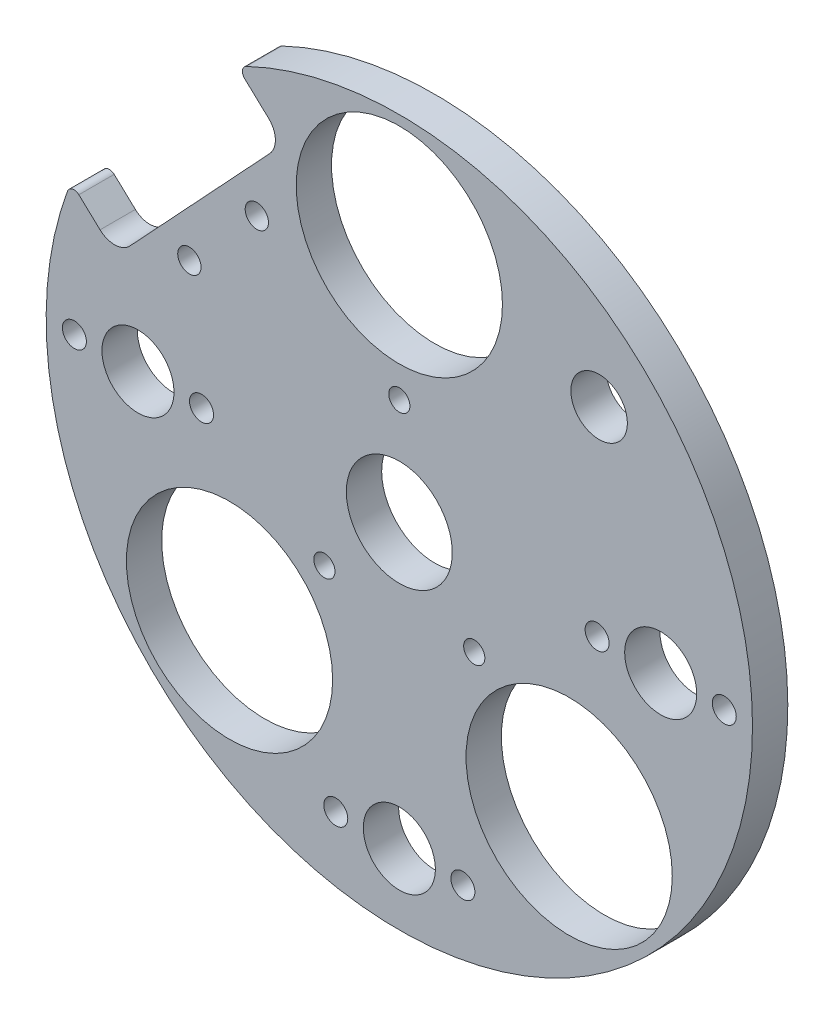
ISO-10303-21;
HEADER;
FILE_DESCRIPTION(('STEP AP214'),'2;1');
FILE_NAME('part.step','',(''),(''),'','','');
FILE_SCHEMA(('AUTOMOTIVE_DESIGN { 1 0 10303 214 1 1 1 1 }'));
ENDSEC;
DATA;
#1=APPLICATION_CONTEXT('core data for automotive mechanical design processes');
#2=APPLICATION_PROTOCOL_DEFINITION('international standard','automotive_design',2000,#1);
#3=PRODUCT_CONTEXT('',#1,'mechanical');
#4=PRODUCT('Part','Part','',(#3));
#5=PRODUCT_RELATED_PRODUCT_CATEGORY('part','',(#4));
#6=PRODUCT_DEFINITION_FORMATION('','',#4);
#7=PRODUCT_DEFINITION_CONTEXT('part definition',#1,'design');
#8=PRODUCT_DEFINITION('design','',#6,#7);
#9=PRODUCT_DEFINITION_SHAPE('','',#8);
#10=(LENGTH_UNIT() NAMED_UNIT(*) SI_UNIT(.MILLI.,.METRE.));
#11=(NAMED_UNIT(*) PLANE_ANGLE_UNIT() SI_UNIT($,.RADIAN.));
#12=(NAMED_UNIT(*) SI_UNIT($,.STERADIAN.) SOLID_ANGLE_UNIT());
#13=UNCERTAINTY_MEASURE_WITH_UNIT(LENGTH_MEASURE(1.E-05),#10,'distance_accuracy_value','');
#14=(GEOMETRIC_REPRESENTATION_CONTEXT(3) GLOBAL_UNCERTAINTY_ASSIGNED_CONTEXT((#13)) GLOBAL_UNIT_ASSIGNED_CONTEXT((#10,
#11,#12)) REPRESENTATION_CONTEXT('',''));
#15=CARTESIAN_POINT('',(0.,0.,0.));
#16=DIRECTION('',(0.,0.,1.));
#17=DIRECTION('',(1.,0.,0.));
#18=AXIS2_PLACEMENT_3D('',#15,#16,#17);
#19=CARTESIAN_POINT('',(0.,0.,5.));
#20=DIRECTION('',(0.,0.,-1.));
#21=DIRECTION('',(-1.,0.,0.));
#22=AXIS2_PLACEMENT_3D('',#19,#20,#21);
#23=CYLINDRICAL_SURFACE('',#22,50.);
#24=CARTESIAN_POINT('',(0.,0.,5.));
#25=DIRECTION('',(0.,0.,1.));
#26=DIRECTION('',(1.,0.,0.));
#27=AXIS2_PLACEMENT_3D('',#24,#25,#26);
#28=CIRCLE('',#27,50.);
#29=CARTESIAN_POINT('',(-46.9912122947557,17.0829144781915,5.));
#30=VERTEX_POINT('',#29);
#31=CARTESIAN_POINT('',(-21.6459347442073,45.0716486169468,5.));
#32=VERTEX_POINT('',#31);
#33=EDGE_CURVE('E148',#30,#32,#28,.T.);
#34=ORIENTED_EDGE('',*,*,#33,.F.);
#35=DIRECTION('',(0.,0.,-1.));
#36=VECTOR('',#35,1.);
#37=CARTESIAN_POINT('',(-46.9912122947557,17.0829144781915,5.));
#38=LINE('',#37,#36);
#39=CARTESIAN_POINT('',(-46.9912122947557,17.0829144781915,0.));
#40=VERTEX_POINT('',#39);
#41=EDGE_CURVE('E303',#30,#40,#38,.T.);
#42=ORIENTED_EDGE('',*,*,#41,.T.);
#43=CARTESIAN_POINT('',(0.,0.,0.));
#44=DIRECTION('',(0.,0.,1.));
#45=DIRECTION('',(1.,0.,0.));
#46=AXIS2_PLACEMENT_3D('',#43,#44,#45);
#47=CIRCLE('',#46,50.);
#48=CARTESIAN_POINT('',(-21.6459347442073,45.0716486169468,0.));
#49=VERTEX_POINT('',#48);
#50=EDGE_CURVE('E270',#40,#49,#47,.T.);
#51=ORIENTED_EDGE('',*,*,#50,.T.);
#52=DIRECTION('',(0.,0.,-1.));
#53=VECTOR('',#52,1.);
#54=CARTESIAN_POINT('',(-21.6459347442073,45.0716486169468,5.));
#55=LINE('',#54,#53);
#56=EDGE_CURVE('E301',#49,#32,#55,.F.);
#57=ORIENTED_EDGE('',*,*,#56,.T.);
#58=EDGE_LOOP('',(#34,#42,#51,#57));
#59=FACE_BOUND('',#58,.T.);
#60=ADVANCED_FACE('F76',(#59),#23,.T.);
#61=CARTESIAN_POINT('',(0.,0.,5.));
#62=DIRECTION('',(0.,0.,1.));
#63=DIRECTION('',(1.,0.,0.));
#64=AXIS2_PLACEMENT_3D('',#61,#62,#63);
#65=PLANE('',#64);
#66=CARTESIAN_POINT('',(28.2842712474618,28.284271247462,5.));
#67=DIRECTION('',(0.,0.,1.));
#68=DIRECTION('',(1.,0.,0.));
#69=AXIS2_PLACEMENT_3D('',#66,#67,#68);
#70=CIRCLE('',#69,4.);
#71=CARTESIAN_POINT('',(32.2842712474618,28.284271247462,5.));
#72=VERTEX_POINT('',#71);
#73=EDGE_CURVE('E294',#72,#72,#70,.T.);
#74=ORIENTED_EDGE('',*,*,#73,.F.);
#75=EDGE_LOOP('',(#74));
#76=FACE_BOUND('',#75,.T.);
#77=CARTESIAN_POINT('',(-29.7224002312924,17.238494510021,5.));
#78=DIRECTION('',(0.,0.,1.));
#79=DIRECTION('',(1.,0.,0.));
#80=AXIS2_PLACEMENT_3D('',#77,#78,#79);
#81=CIRCLE('',#80,1.65);
#82=CARTESIAN_POINT('',(-28.0724002312924,17.238494510021,5.));
#83=VERTEX_POINT('',#82);
#84=EDGE_CURVE('E687',#83,#83,#81,.T.);
#85=ORIENTED_EDGE('',*,*,#84,.F.);
#86=EDGE_LOOP('',(#85));
#87=FACE_BOUND('',#86,.T.);
#88=CARTESIAN_POINT('',(-20.1744231904173,27.4774463326894,5.));
#89=DIRECTION('',(0.,0.,1.));
#90=DIRECTION('',(1.,0.,0.));
#91=AXIS2_PLACEMENT_3D('',#88,#89,#90);
#92=CIRCLE('',#91,1.65);
#93=CARTESIAN_POINT('',(-18.5244231904173,27.4774463326894,5.));
#94=VERTEX_POINT('',#93);
#95=EDGE_CURVE('E179',#94,#94,#92,.T.);
#96=ORIENTED_EDGE('',*,*,#95,.F.);
#97=EDGE_LOOP('',(#96));
#98=FACE_BOUND('',#97,.T.);
#99=CARTESIAN_POINT('',(0.,34.,5.));
#100=DIRECTION('',(0.,0.,1.));
#101=DIRECTION('',(1.,0.,0.));
#102=AXIS2_PLACEMENT_3D('',#99,#100,#101);
#103=CIRCLE('',#102,14.6);
#104=CARTESIAN_POINT('',(14.6,34.,5.));
#105=VERTEX_POINT('',#104);
#106=EDGE_CURVE('E193',#105,#105,#103,.T.);
#107=ORIENTED_EDGE('',*,*,#106,.F.);
#108=EDGE_LOOP('',(#107));
#109=FACE_BOUND('',#108,.T.);
#110=CARTESIAN_POINT('',(-10.6066017177983,-10.6066017177982,5.));
#111=DIRECTION('',(0.,0.,1.));
#112=DIRECTION('',(1.,0.,0.));
#113=AXIS2_PLACEMENT_3D('',#110,#111,#112);
#114=CIRCLE('',#113,1.5);
#115=CARTESIAN_POINT('',(-9.10660171779826,-10.6066017177982,5.));
#116=VERTEX_POINT('',#115);
#117=EDGE_CURVE('E194',#116,#116,#114,.T.);
#118=ORIENTED_EDGE('',*,*,#117,.F.);
#119=EDGE_LOOP('',(#118));
#120=FACE_BOUND('',#119,.T.);
#121=CARTESIAN_POINT('',(-24.0416305603427,-24.0416305603425,5.));
#122=DIRECTION('',(0.,0.,1.));
#123=DIRECTION('',(1.,0.,0.));
#124=AXIS2_PLACEMENT_3D('',#121,#122,#123);
#125=CIRCLE('',#124,14.6);
#126=CARTESIAN_POINT('',(-9.44163056034274,-24.0416305603425,5.));
#127=VERTEX_POINT('',#126);
#128=EDGE_CURVE('E197',#127,#127,#125,.T.);
#129=ORIENTED_EDGE('',*,*,#128,.F.);
#130=EDGE_LOOP('',(#129));
#131=FACE_BOUND('',#130,.T.);
#132=CARTESIAN_POINT('',(10.6066017177982,-10.6066017177982,5.));
#133=DIRECTION('',(0.,0.,1.));
#134=DIRECTION('',(1.,0.,0.));
#135=AXIS2_PLACEMENT_3D('',#132,#133,#134);
#136=CIRCLE('',#135,1.5);
#137=CARTESIAN_POINT('',(12.1066017177982,-10.6066017177982,5.));
#138=VERTEX_POINT('',#137);
#139=EDGE_CURVE('E200',#138,#138,#136,.T.);
#140=ORIENTED_EDGE('',*,*,#139,.F.);
#141=EDGE_LOOP('',(#140));
#142=FACE_BOUND('',#141,.T.);
#143=CARTESIAN_POINT('',(0.,15.,5.));
#144=DIRECTION('',(0.,0.,1.));
#145=DIRECTION('',(1.,0.,0.));
#146=AXIS2_PLACEMENT_3D('',#143,#144,#145);
#147=CIRCLE('',#146,1.5);
#148=CARTESIAN_POINT('',(1.5,15.,5.));
#149=VERTEX_POINT('',#148);
#150=EDGE_CURVE('E156',#149,#149,#147,.T.);
#151=ORIENTED_EDGE('',*,*,#150,.F.);
#152=EDGE_LOOP('',(#151));
#153=FACE_BOUND('',#152,.T.);
#154=CARTESIAN_POINT('',(24.0416305603426,-24.0416305603427,5.));
#155=DIRECTION('',(0.,0.,1.));
#156=DIRECTION('',(1.,0.,0.));
#157=AXIS2_PLACEMENT_3D('',#154,#155,#156);
#158=CIRCLE('',#157,14.6);
#159=CARTESIAN_POINT('',(38.6416305603426,-24.0416305603427,5.));
#160=VERTEX_POINT('',#159);
#161=EDGE_CURVE('E203',#160,#160,#158,.T.);
#162=ORIENTED_EDGE('',*,*,#161,.F.);
#163=EDGE_LOOP('',(#162));
#164=FACE_BOUND('',#163,.T.);
#165=CARTESIAN_POINT('',(46.,0.,5.));
#166=DIRECTION('',(0.,0.,1.));
#167=DIRECTION('',(1.,0.,0.));
#168=AXIS2_PLACEMENT_3D('',#165,#166,#167);
#169=CIRCLE('',#168,1.7);
#170=CARTESIAN_POINT('',(47.7,0.,5.));
#171=VERTEX_POINT('',#170);
#172=EDGE_CURVE('E209',#171,#171,#169,.T.);
#173=ORIENTED_EDGE('',*,*,#172,.F.);
#174=EDGE_LOOP('',(#173));
#175=FACE_BOUND('',#174,.T.);
#176=CARTESIAN_POINT('',(28.,0.,5.));
#177=DIRECTION('',(0.,0.,1.));
#178=DIRECTION('',(1.,0.,0.));
#179=AXIS2_PLACEMENT_3D('',#176,#177,#178);
#180=CIRCLE('',#179,1.7);
#181=CARTESIAN_POINT('',(29.7,0.,5.));
#182=VERTEX_POINT('',#181);
#183=EDGE_CURVE('E216',#182,#182,#180,.T.);
#184=ORIENTED_EDGE('',*,*,#183,.F.);
#185=EDGE_LOOP('',(#184));
#186=FACE_BOUND('',#185,.T.);
#187=CARTESIAN_POINT('',(9.,-40.,5.));
#188=DIRECTION('',(0.,0.,1.));
#189=DIRECTION('',(1.,0.,0.));
#190=AXIS2_PLACEMENT_3D('',#187,#188,#189);
#191=CIRCLE('',#190,1.7);
#192=CARTESIAN_POINT('',(10.7,-40.,5.));
#193=VERTEX_POINT('',#192);
#194=EDGE_CURVE('E222',#193,#193,#191,.T.);
#195=ORIENTED_EDGE('',*,*,#194,.F.);
#196=EDGE_LOOP('',(#195));
#197=FACE_BOUND('',#196,.T.);
#198=CARTESIAN_POINT('',(-9.,-40.,5.));
#199=DIRECTION('',(0.,0.,1.));
#200=DIRECTION('',(1.,0.,0.));
#201=AXIS2_PLACEMENT_3D('',#198,#199,#200);
#202=CIRCLE('',#201,1.7);
#203=CARTESIAN_POINT('',(-7.3,-40.,5.));
#204=VERTEX_POINT('',#203);
#205=EDGE_CURVE('E228',#204,#204,#202,.T.);
#206=ORIENTED_EDGE('',*,*,#205,.F.);
#207=EDGE_LOOP('',(#206));
#208=FACE_BOUND('',#207,.T.);
#209=CARTESIAN_POINT('',(-46.,2.97129651685814E-13,5.));
#210=DIRECTION('',(0.,0.,1.));
#211=DIRECTION('',(1.,0.,0.));
#212=AXIS2_PLACEMENT_3D('',#209,#210,#211);
#213=CIRCLE('',#212,1.7);
#214=CARTESIAN_POINT('',(-44.3,2.97129651685814E-13,5.));
#215=VERTEX_POINT('',#214);
#216=EDGE_CURVE('E234',#215,#215,#213,.T.);
#217=ORIENTED_EDGE('',*,*,#216,.F.);
#218=EDGE_LOOP('',(#217));
#219=FACE_BOUND('',#218,.T.);
#220=CARTESIAN_POINT('',(-28.,-1.71810817162361E-12,5.));
#221=DIRECTION('',(0.,0.,1.));
#222=DIRECTION('',(1.,0.,0.));
#223=AXIS2_PLACEMENT_3D('',#220,#221,#222);
#224=CIRCLE('',#223,1.7);
#225=CARTESIAN_POINT('',(-26.3,-1.71810817162361E-12,5.));
#226=VERTEX_POINT('',#225);
#227=EDGE_CURVE('E240',#226,#226,#224,.T.);
#228=ORIENTED_EDGE('',*,*,#227,.F.);
#229=EDGE_LOOP('',(#228));
#230=FACE_BOUND('',#229,.T.);
#231=CARTESIAN_POINT('',(-37.,0.,5.));
#232=DIRECTION('',(0.,0.,-1.));
#233=DIRECTION('',(-1.,0.,0.));
#234=AXIS2_PLACEMENT_3D('',#231,#232,#233);
#235=CIRCLE('',#234,5.1);
#236=CARTESIAN_POINT('',(-42.1,0.,5.));
#237=VERTEX_POINT('',#236);
#238=EDGE_CURVE('E249',#237,#237,#235,.T.);
#239=ORIENTED_EDGE('',*,*,#238,.T.);
#240=EDGE_LOOP('',(#239));
#241=FACE_BOUND('',#240,.T.);
#242=CARTESIAN_POINT('',(37.,2.68166793467571E-13,5.));
#243=DIRECTION('',(0.,0.,-1.));
#244=DIRECTION('',(-1.,0.,0.));
#245=AXIS2_PLACEMENT_3D('',#242,#243,#244);
#246=CIRCLE('',#245,5.1);
#247=CARTESIAN_POINT('',(31.9,2.68166793467571E-13,5.));
#248=VERTEX_POINT('',#247);
#249=EDGE_CURVE('E255',#248,#248,#246,.T.);
#250=ORIENTED_EDGE('',*,*,#249,.T.);
#251=EDGE_LOOP('',(#250));
#252=FACE_BOUND('',#251,.T.);
#253=CARTESIAN_POINT('',(0.,-40.,5.));
#254=DIRECTION('',(0.,0.,-1.));
#255=DIRECTION('',(-1.,0.,0.));
#256=AXIS2_PLACEMENT_3D('',#253,#254,#255);
#257=CIRCLE('',#256,5.1);
#258=CARTESIAN_POINT('',(-5.1,-40.,5.));
#259=VERTEX_POINT('',#258);
#260=EDGE_CURVE('E261',#259,#259,#257,.T.);
#261=ORIENTED_EDGE('',*,*,#260,.T.);
#262=EDGE_LOOP('',(#261));
#263=FACE_BOUND('',#262,.T.);
#264=CARTESIAN_POINT('',(0.,0.,5.));
#265=DIRECTION('',(0.,0.,-1.));
#266=DIRECTION('',(-1.,0.,0.));
#267=AXIS2_PLACEMENT_3D('',#264,#265,#266);
#268=CIRCLE('',#267,7.5);
#269=CARTESIAN_POINT('',(-7.5,0.,5.));
#270=VERTEX_POINT('',#269);
#271=EDGE_CURVE('E267',#270,#270,#268,.T.);
#272=ORIENTED_EDGE('',*,*,#271,.T.);
#273=EDGE_LOOP('',(#272));
#274=FACE_BOUND('',#273,.T.);
#275=DIRECTION('',(-0.731353701619166,0.681998360062504,0.));
#276=VECTOR('',#275,1.);
#277=CARTESIAN_POINT('',(-42.3685357740924,14.6742683434885,5.));
#278=LINE('',#277,#276);
#279=CARTESIAN_POINT('',(-42.3685357740924,14.6742683434885,5.));
#280=VERTEX_POINT('',#279);
#281=CARTESIAN_POINT('',(-45.369389688798,17.4726098902468,5.));
#282=VERTEX_POINT('',#281);
#283=EDGE_CURVE('E175',#280,#282,#278,.T.);
#284=ORIENTED_EDGE('',*,*,#283,.T.);
#285=CARTESIAN_POINT('',(-46.0513880488605,16.7412561886277,5.));
#286=DIRECTION('',(0.,0.,1.));
#287=DIRECTION('',(1.,0.,0.));
#288=AXIS2_PLACEMENT_3D('',#285,#286,#287);
#289=CIRCLE('',#288,1.);
#290=EDGE_CURVE('E299',#282,#30,#289,.T.);
#291=ORIENTED_EDGE('',*,*,#290,.T.);
#292=ORIENTED_EDGE('',*,*,#33,.T.);
#293=CARTESIAN_POINT('',(-21.2130160493231,44.1702156446078,5.));
#294=DIRECTION('',(0.,0.,1.));
#295=DIRECTION('',(1.,0.,0.));
#296=AXIS2_PLACEMENT_3D('',#293,#294,#295);
#297=CIRCLE('',#296,1.);
#298=CARTESIAN_POINT('',(-21.8950144093856,43.4388619429887,5.));
#299=VERTEX_POINT('',#298);
#300=EDGE_CURVE('E297',#32,#299,#297,.T.);
#301=ORIENTED_EDGE('',*,*,#300,.T.);
#302=DIRECTION('',(0.731353701619168,-0.681998360062502,0.));
#303=VECTOR('',#302,1.);
#304=CARTESIAN_POINT('',(-27.2748375913348,48.4556282209094,5.));
#305=LINE('',#304,#303);
#306=CARTESIAN_POINT('',(-18.4985931719048,40.2716479001594,5.));
#307=VERTEX_POINT('',#306);
#308=EDGE_CURVE('E178',#299,#307,#305,.T.);
#309=ORIENTED_EDGE('',*,*,#308,.T.);
#310=CARTESIAN_POINT('',(-20.5445882520923,38.0775867953019,5.));
#311=DIRECTION('',(0.,0.,-1.));
#312=DIRECTION('',(-1.,0.,0.));
#313=AXIS2_PLACEMENT_3D('',#310,#311,#312);
#314=CIRCLE('',#313,3.00000000000001);
#315=CARTESIAN_POINT('',(-18.3505271472348,36.0315917151144,5.));
#316=VERTEX_POINT('',#315);
#317=EDGE_CURVE('E155',#307,#316,#314,.T.);
#318=ORIENTED_EDGE('',*,*,#317,.T.);
#319=DIRECTION('',(-0.681998360062502,-0.731353701619167,0.));
#320=VECTOR('',#319,1.);
#321=CARTESIAN_POINT('',(-18.3505271472348,36.0315917151144,5.));
#322=LINE('',#321,#320);
#323=CARTESIAN_POINT('',(-38.1284795890474,14.8223343681585,5.));
#324=VERTEX_POINT('',#323);
#325=EDGE_CURVE('E182',#316,#324,#322,.T.);
#326=ORIENTED_EDGE('',*,*,#325,.T.);
#327=CARTESIAN_POINT('',(-40.3225406939049,16.868329448346,5.));
#328=DIRECTION('',(0.,0.,1.));
#329=DIRECTION('',(1.,0.,0.));
#330=AXIS2_PLACEMENT_3D('',#327,#328,#329);
#331=CIRCLE('',#330,3.00000000000001);
#332=EDGE_CURVE('E169',#280,#324,#331,.T.);
#333=ORIENTED_EDGE('',*,*,#332,.F.);
#334=EDGE_LOOP('',(#284,#291,#292,#301,#309,#318,#326,#333));
#335=FACE_BOUND('',#334,.T.);
#336=ADVANCED_FACE('F317',(#76,#87,#98,#109,#120,#131,#142,#153,#164,#175,#186,#197,#208,#219,
#230,#241,#252,#263,#274,#335),#65,.T.);
#337=CARTESIAN_POINT('',(0.,0.,0.));
#338=DIRECTION('',(0.,0.,1.));
#339=DIRECTION('',(1.,0.,0.));
#340=AXIS2_PLACEMENT_3D('',#337,#338,#339);
#341=PLANE('',#340);
#342=CARTESIAN_POINT('',(28.2842712474618,28.284271247462,0.));
#343=DIRECTION('',(0.,0.,1.));
#344=DIRECTION('',(1.,0.,0.));
#345=AXIS2_PLACEMENT_3D('',#342,#343,#344);
#346=CIRCLE('',#345,4.);
#347=CARTESIAN_POINT('',(32.2842712474618,28.284271247462,0.));
#348=VERTEX_POINT('',#347);
#349=EDGE_CURVE('E290',#348,#348,#346,.T.);
#350=ORIENTED_EDGE('',*,*,#349,.T.);
#351=EDGE_LOOP('',(#350));
#352=FACE_BOUND('',#351,.T.);
#353=CARTESIAN_POINT('',(-29.7224002312924,17.238494510021,0.));
#354=DIRECTION('',(0.,0.,1.));
#355=DIRECTION('',(1.,0.,0.));
#356=AXIS2_PLACEMENT_3D('',#353,#354,#355);
#357=CIRCLE('',#356,1.65);
#358=CARTESIAN_POINT('',(-28.0724002312924,17.238494510021,0.));
#359=VERTEX_POINT('',#358);
#360=EDGE_CURVE('E293',#359,#359,#357,.T.);
#361=ORIENTED_EDGE('',*,*,#360,.T.);
#362=EDGE_LOOP('',(#361));
#363=FACE_BOUND('',#362,.T.);
#364=CARTESIAN_POINT('',(-20.1744231904173,27.4774463326894,0.));
#365=DIRECTION('',(0.,0.,1.));
#366=DIRECTION('',(1.,0.,0.));
#367=AXIS2_PLACEMENT_3D('',#364,#365,#366);
#368=CIRCLE('',#367,1.65);
#369=CARTESIAN_POINT('',(-18.5244231904173,27.4774463326894,0.));
#370=VERTEX_POINT('',#369);
#371=EDGE_CURVE('E372',#370,#370,#368,.T.);
#372=ORIENTED_EDGE('',*,*,#371,.T.);
#373=EDGE_LOOP('',(#372));
#374=FACE_BOUND('',#373,.T.);
#375=CARTESIAN_POINT('',(0.,0.,0.));
#376=DIRECTION('',(0.,0.,-1.));
#377=DIRECTION('',(-1.,0.,0.));
#378=AXIS2_PLACEMENT_3D('',#375,#376,#377);
#379=CIRCLE('',#378,7.5);
#380=CARTESIAN_POINT('',(-7.5,0.,0.));
#381=VERTEX_POINT('',#380);
#382=EDGE_CURVE('E264',#381,#381,#379,.T.);
#383=ORIENTED_EDGE('',*,*,#382,.F.);
#384=EDGE_LOOP('',(#383));
#385=FACE_BOUND('',#384,.T.);
#386=CARTESIAN_POINT('',(0.,-40.,0.));
#387=DIRECTION('',(0.,0.,-1.));
#388=DIRECTION('',(-1.,0.,0.));
#389=AXIS2_PLACEMENT_3D('',#386,#387,#388);
#390=CIRCLE('',#389,5.1);
#391=CARTESIAN_POINT('',(-5.1,-40.,0.));
#392=VERTEX_POINT('',#391);
#393=EDGE_CURVE('E258',#392,#392,#390,.T.);
#394=ORIENTED_EDGE('',*,*,#393,.F.);
#395=EDGE_LOOP('',(#394));
#396=FACE_BOUND('',#395,.T.);
#397=CARTESIAN_POINT('',(37.,2.68166793467571E-13,0.));
#398=DIRECTION('',(0.,0.,-1.));
#399=DIRECTION('',(-1.,0.,0.));
#400=AXIS2_PLACEMENT_3D('',#397,#398,#399);
#401=CIRCLE('',#400,5.1);
#402=CARTESIAN_POINT('',(31.9,2.68166793467571E-13,0.));
#403=VERTEX_POINT('',#402);
#404=EDGE_CURVE('E252',#403,#403,#401,.T.);
#405=ORIENTED_EDGE('',*,*,#404,.F.);
#406=EDGE_LOOP('',(#405));
#407=FACE_BOUND('',#406,.T.);
#408=CARTESIAN_POINT('',(-37.,0.,0.));
#409=DIRECTION('',(0.,0.,-1.));
#410=DIRECTION('',(-1.,0.,0.));
#411=AXIS2_PLACEMENT_3D('',#408,#409,#410);
#412=CIRCLE('',#411,5.1);
#413=CARTESIAN_POINT('',(-42.1,0.,0.));
#414=VERTEX_POINT('',#413);
#415=EDGE_CURVE('E246',#414,#414,#412,.T.);
#416=ORIENTED_EDGE('',*,*,#415,.F.);
#417=EDGE_LOOP('',(#416));
#418=FACE_BOUND('',#417,.T.);
#419=CARTESIAN_POINT('',(-28.,-1.71810817162361E-12,0.));
#420=DIRECTION('',(0.,0.,1.));
#421=DIRECTION('',(1.,0.,0.));
#422=AXIS2_PLACEMENT_3D('',#419,#420,#421);
#423=CIRCLE('',#422,1.7);
#424=CARTESIAN_POINT('',(-26.3,-1.71810817162361E-12,0.));
#425=VERTEX_POINT('',#424);
#426=EDGE_CURVE('E243',#425,#425,#423,.T.);
#427=ORIENTED_EDGE('',*,*,#426,.T.);
#428=EDGE_LOOP('',(#427));
#429=FACE_BOUND('',#428,.T.);
#430=CARTESIAN_POINT('',(-46.,2.97129651685814E-13,0.));
#431=DIRECTION('',(0.,0.,1.));
#432=DIRECTION('',(1.,0.,0.));
#433=AXIS2_PLACEMENT_3D('',#430,#431,#432);
#434=CIRCLE('',#433,1.7);
#435=CARTESIAN_POINT('',(-44.3,2.97129651685814E-13,0.));
#436=VERTEX_POINT('',#435);
#437=EDGE_CURVE('E237',#436,#436,#434,.T.);
#438=ORIENTED_EDGE('',*,*,#437,.T.);
#439=EDGE_LOOP('',(#438));
#440=FACE_BOUND('',#439,.T.);
#441=CARTESIAN_POINT('',(-9.,-40.,0.));
#442=DIRECTION('',(0.,0.,1.));
#443=DIRECTION('',(1.,0.,0.));
#444=AXIS2_PLACEMENT_3D('',#441,#442,#443);
#445=CIRCLE('',#444,1.7);
#446=CARTESIAN_POINT('',(-7.3,-40.,0.));
#447=VERTEX_POINT('',#446);
#448=EDGE_CURVE('E231',#447,#447,#445,.T.);
#449=ORIENTED_EDGE('',*,*,#448,.T.);
#450=EDGE_LOOP('',(#449));
#451=FACE_BOUND('',#450,.T.);
#452=CARTESIAN_POINT('',(9.,-40.,0.));
#453=DIRECTION('',(0.,0.,1.));
#454=DIRECTION('',(1.,0.,0.));
#455=AXIS2_PLACEMENT_3D('',#452,#453,#454);
#456=CIRCLE('',#455,1.7);
#457=CARTESIAN_POINT('',(10.7,-40.,0.));
#458=VERTEX_POINT('',#457);
#459=EDGE_CURVE('E225',#458,#458,#456,.T.);
#460=ORIENTED_EDGE('',*,*,#459,.T.);
#461=EDGE_LOOP('',(#460));
#462=FACE_BOUND('',#461,.T.);
#463=CARTESIAN_POINT('',(28.,0.,0.));
#464=DIRECTION('',(0.,0.,1.));
#465=DIRECTION('',(1.,0.,0.));
#466=AXIS2_PLACEMENT_3D('',#463,#464,#465);
#467=CIRCLE('',#466,1.7);
#468=CARTESIAN_POINT('',(29.7,0.,0.));
#469=VERTEX_POINT('',#468);
#470=EDGE_CURVE('E219',#469,#469,#467,.T.);
#471=ORIENTED_EDGE('',*,*,#470,.T.);
#472=EDGE_LOOP('',(#471));
#473=FACE_BOUND('',#472,.T.);
#474=CARTESIAN_POINT('',(46.,0.,0.));
#475=DIRECTION('',(0.,0.,1.));
#476=DIRECTION('',(1.,0.,0.));
#477=AXIS2_PLACEMENT_3D('',#474,#475,#476);
#478=CIRCLE('',#477,1.7);
#479=CARTESIAN_POINT('',(47.7,0.,0.));
#480=VERTEX_POINT('',#479);
#481=EDGE_CURVE('E212',#480,#480,#478,.T.);
#482=ORIENTED_EDGE('',*,*,#481,.T.);
#483=EDGE_LOOP('',(#482));
#484=FACE_BOUND('',#483,.T.);
#485=CARTESIAN_POINT('',(24.0416305603426,-24.0416305603427,0.));
#486=DIRECTION('',(0.,0.,1.));
#487=DIRECTION('',(1.,0.,0.));
#488=AXIS2_PLACEMENT_3D('',#485,#486,#487);
#489=CIRCLE('',#488,14.6);
#490=CARTESIAN_POINT('',(38.6416305603426,-24.0416305603427,0.));
#491=VERTEX_POINT('',#490);
#492=EDGE_CURVE('E208',#491,#491,#489,.T.);
#493=ORIENTED_EDGE('',*,*,#492,.T.);
#494=EDGE_LOOP('',(#493));
#495=FACE_BOUND('',#494,.T.);
#496=CARTESIAN_POINT('',(0.,15.,0.));
#497=DIRECTION('',(0.,0.,1.));
#498=DIRECTION('',(1.,0.,0.));
#499=AXIS2_PLACEMENT_3D('',#496,#497,#498);
#500=CIRCLE('',#499,1.5);
#501=CARTESIAN_POINT('',(1.5,15.,0.));
#502=VERTEX_POINT('',#501);
#503=EDGE_CURVE('E276',#502,#502,#500,.T.);
#504=ORIENTED_EDGE('',*,*,#503,.T.);
#505=EDGE_LOOP('',(#504));
#506=FACE_BOUND('',#505,.T.);
#507=CARTESIAN_POINT('',(10.6066017177982,-10.6066017177982,0.));
#508=DIRECTION('',(0.,0.,1.));
#509=DIRECTION('',(1.,0.,0.));
#510=AXIS2_PLACEMENT_3D('',#507,#508,#509);
#511=CIRCLE('',#510,1.5);
#512=CARTESIAN_POINT('',(12.1066017177982,-10.6066017177982,0.));
#513=VERTEX_POINT('',#512);
#514=EDGE_CURVE('E279',#513,#513,#511,.T.);
#515=ORIENTED_EDGE('',*,*,#514,.T.);
#516=EDGE_LOOP('',(#515));
#517=FACE_BOUND('',#516,.T.);
#518=CARTESIAN_POINT('',(-24.0416305603427,-24.0416305603425,0.));
#519=DIRECTION('',(0.,0.,1.));
#520=DIRECTION('',(1.,0.,0.));
#521=AXIS2_PLACEMENT_3D('',#518,#519,#520);
#522=CIRCLE('',#521,14.6);
#523=CARTESIAN_POINT('',(-9.44163056034274,-24.0416305603425,0.));
#524=VERTEX_POINT('',#523);
#525=EDGE_CURVE('E282',#524,#524,#522,.T.);
#526=ORIENTED_EDGE('',*,*,#525,.T.);
#527=EDGE_LOOP('',(#526));
#528=FACE_BOUND('',#527,.T.);
#529=CARTESIAN_POINT('',(-10.6066017177983,-10.6066017177982,0.));
#530=DIRECTION('',(0.,0.,1.));
#531=DIRECTION('',(1.,0.,0.));
#532=AXIS2_PLACEMENT_3D('',#529,#530,#531);
#533=CIRCLE('',#532,1.5);
#534=CARTESIAN_POINT('',(-9.10660171779826,-10.6066017177982,0.));
#535=VERTEX_POINT('',#534);
#536=EDGE_CURVE('E285',#535,#535,#533,.T.);
#537=ORIENTED_EDGE('',*,*,#536,.T.);
#538=EDGE_LOOP('',(#537));
#539=FACE_BOUND('',#538,.T.);
#540=CARTESIAN_POINT('',(0.,34.,0.));
#541=DIRECTION('',(0.,0.,1.));
#542=DIRECTION('',(1.,0.,0.));
#543=AXIS2_PLACEMENT_3D('',#540,#541,#542);
#544=CIRCLE('',#543,14.6);
#545=CARTESIAN_POINT('',(14.6,34.,0.));
#546=VERTEX_POINT('',#545);
#547=EDGE_CURVE('E213',#546,#546,#544,.T.);
#548=ORIENTED_EDGE('',*,*,#547,.T.);
#549=EDGE_LOOP('',(#548));
#550=FACE_BOUND('',#549,.T.);
#551=ORIENTED_EDGE('',*,*,#50,.F.);
#552=CARTESIAN_POINT('',(-46.0513880488605,16.7412561886277,0.));
#553=DIRECTION('',(0.,0.,1.));
#554=DIRECTION('',(1.,0.,0.));
#555=AXIS2_PLACEMENT_3D('',#552,#553,#554);
#556=CIRCLE('',#555,1.);
#557=CARTESIAN_POINT('',(-45.369389688798,17.4726098902468,0.));
#558=VERTEX_POINT('',#557);
#559=EDGE_CURVE('E84',#40,#558,#556,.F.);
#560=ORIENTED_EDGE('',*,*,#559,.T.);
#561=DIRECTION('',(-0.731353701619166,0.681998360062504,0.));
#562=VECTOR('',#561,1.);
#563=CARTESIAN_POINT('',(-42.3685357740924,14.6742683434885,0.));
#564=LINE('',#563,#562);
#565=CARTESIAN_POINT('',(-42.3685357740924,14.6742683434885,0.));
#566=VERTEX_POINT('',#565);
#567=EDGE_CURVE('E164',#566,#558,#564,.T.);
#568=ORIENTED_EDGE('',*,*,#567,.F.);
#569=CARTESIAN_POINT('',(-40.3225406939049,16.868329448346,0.));
#570=DIRECTION('',(0.,0.,1.));
#571=DIRECTION('',(1.,0.,0.));
#572=AXIS2_PLACEMENT_3D('',#569,#570,#571);
#573=CIRCLE('',#572,3.00000000000001);
#574=CARTESIAN_POINT('',(-38.1284795890474,14.8223343681585,0.));
#575=VERTEX_POINT('',#574);
#576=EDGE_CURVE('E166',#566,#575,#573,.T.);
#577=ORIENTED_EDGE('',*,*,#576,.T.);
#578=DIRECTION('',(-0.681998360062502,-0.731353701619167,0.));
#579=VECTOR('',#578,1.);
#580=CARTESIAN_POINT('',(-18.3505271472348,36.0315917151144,0.));
#581=LINE('',#580,#579);
#582=CARTESIAN_POINT('',(-18.3505271472348,36.0315917151144,0.));
#583=VERTEX_POINT('',#582);
#584=EDGE_CURVE('E163',#583,#575,#581,.T.);
#585=ORIENTED_EDGE('',*,*,#584,.F.);
#586=CARTESIAN_POINT('',(-20.5445882520923,38.0775867953019,0.));
#587=DIRECTION('',(0.,0.,-1.));
#588=DIRECTION('',(-1.,0.,0.));
#589=AXIS2_PLACEMENT_3D('',#586,#587,#588);
#590=CIRCLE('',#589,3.00000000000001);
#591=CARTESIAN_POINT('',(-18.4985931719048,40.2716479001594,0.));
#592=VERTEX_POINT('',#591);
#593=EDGE_CURVE('E152',#592,#583,#590,.T.);
#594=ORIENTED_EDGE('',*,*,#593,.F.);
#595=DIRECTION('',(0.731353701619168,-0.681998360062502,0.));
#596=VECTOR('',#595,1.);
#597=CARTESIAN_POINT('',(11.4826758234574,12.3136622604325,0.));
#598=LINE('',#597,#596);
#599=CARTESIAN_POINT('',(-21.8950144093856,43.4388619429887,0.));
#600=VERTEX_POINT('',#599);
#601=EDGE_CURVE('E140',#600,#592,#598,.T.);
#602=ORIENTED_EDGE('',*,*,#601,.F.);
#603=CARTESIAN_POINT('',(-21.2130160493231,44.1702156446078,0.));
#604=DIRECTION('',(0.,0.,1.));
#605=DIRECTION('',(1.,0.,0.));
#606=AXIS2_PLACEMENT_3D('',#603,#604,#605);
#607=CIRCLE('',#606,1.);
#608=EDGE_CURVE('E91',#600,#49,#607,.F.);
#609=ORIENTED_EDGE('',*,*,#608,.T.);
#610=EDGE_LOOP('',(#551,#560,#568,#577,#585,#594,#602,#609));
#611=FACE_BOUND('',#610,.T.);
#612=ADVANCED_FACE('F160',(#352,#363,#374,#385,#396,#407,#418,#429,#440,#451,#462,#473,#484,
#495,#506,#517,#528,#539,#550,#611),#341,.F.);
#613=CARTESIAN_POINT('',(0.,0.,0.));
#614=DIRECTION('',(0.,0.,-1.));
#615=DIRECTION('',(-1.,0.,0.));
#616=AXIS2_PLACEMENT_3D('',#613,#614,#615);
#617=CYLINDRICAL_SURFACE('',#616,7.5);
#618=ORIENTED_EDGE('',*,*,#271,.F.);
#619=EDGE_LOOP('',(#618));
#620=FACE_BOUND('',#619,.T.);
#621=ORIENTED_EDGE('',*,*,#382,.T.);
#622=EDGE_LOOP('',(#621));
#623=FACE_BOUND('',#622,.T.);
#624=ADVANCED_FACE('F365',(#620,#623),#617,.F.);
#625=CARTESIAN_POINT('',(0.,-40.,0.));
#626=DIRECTION('',(0.,0.,-1.));
#627=DIRECTION('',(-1.,0.,0.));
#628=AXIS2_PLACEMENT_3D('',#625,#626,#627);
#629=CYLINDRICAL_SURFACE('',#628,5.1);
#630=ORIENTED_EDGE('',*,*,#260,.F.);
#631=EDGE_LOOP('',(#630));
#632=FACE_BOUND('',#631,.T.);
#633=ORIENTED_EDGE('',*,*,#393,.T.);
#634=EDGE_LOOP('',(#633));
#635=FACE_BOUND('',#634,.T.);
#636=ADVANCED_FACE('F463',(#632,#635),#629,.F.);
#637=CARTESIAN_POINT('',(37.,2.68166793467571E-13,0.));
#638=DIRECTION('',(0.,0.,-1.));
#639=DIRECTION('',(-1.,0.,0.));
#640=AXIS2_PLACEMENT_3D('',#637,#638,#639);
#641=CYLINDRICAL_SURFACE('',#640,5.1);
#642=ORIENTED_EDGE('',*,*,#249,.F.);
#643=EDGE_LOOP('',(#642));
#644=FACE_BOUND('',#643,.T.);
#645=ORIENTED_EDGE('',*,*,#404,.T.);
#646=EDGE_LOOP('',(#645));
#647=FACE_BOUND('',#646,.T.);
#648=ADVANCED_FACE('F459',(#644,#647),#641,.F.);
#649=CARTESIAN_POINT('',(-37.,0.,0.));
#650=DIRECTION('',(0.,0.,-1.));
#651=DIRECTION('',(-1.,0.,0.));
#652=AXIS2_PLACEMENT_3D('',#649,#650,#651);
#653=CYLINDRICAL_SURFACE('',#652,5.1);
#654=ORIENTED_EDGE('',*,*,#238,.F.);
#655=EDGE_LOOP('',(#654));
#656=FACE_BOUND('',#655,.T.);
#657=ORIENTED_EDGE('',*,*,#415,.T.);
#658=EDGE_LOOP('',(#657));
#659=FACE_BOUND('',#658,.T.);
#660=ADVANCED_FACE('F455',(#656,#659),#653,.F.);
#661=CARTESIAN_POINT('',(-28.,-1.71810817162361E-12,5.));
#662=DIRECTION('',(0.,0.,1.));
#663=DIRECTION('',(1.,0.,0.));
#664=AXIS2_PLACEMENT_3D('',#661,#662,#663);
#665=CYLINDRICAL_SURFACE('',#664,1.7);
#666=ORIENTED_EDGE('',*,*,#426,.F.);
#667=EDGE_LOOP('',(#666));
#668=FACE_BOUND('',#667,.T.);
#669=ORIENTED_EDGE('',*,*,#227,.T.);
#670=EDGE_LOOP('',(#669));
#671=FACE_BOUND('',#670,.T.);
#672=ADVANCED_FACE('F451',(#668,#671),#665,.F.);
#673=CARTESIAN_POINT('',(-46.,2.97129651685814E-13,5.));
#674=DIRECTION('',(0.,0.,1.));
#675=DIRECTION('',(1.,0.,0.));
#676=AXIS2_PLACEMENT_3D('',#673,#674,#675);
#677=CYLINDRICAL_SURFACE('',#676,1.7);
#678=ORIENTED_EDGE('',*,*,#437,.F.);
#679=EDGE_LOOP('',(#678));
#680=FACE_BOUND('',#679,.T.);
#681=ORIENTED_EDGE('',*,*,#216,.T.);
#682=EDGE_LOOP('',(#681));
#683=FACE_BOUND('',#682,.T.);
#684=ADVANCED_FACE('F447',(#680,#683),#677,.F.);
#685=CARTESIAN_POINT('',(-9.,-40.,5.));
#686=DIRECTION('',(0.,0.,1.));
#687=DIRECTION('',(1.,0.,0.));
#688=AXIS2_PLACEMENT_3D('',#685,#686,#687);
#689=CYLINDRICAL_SURFACE('',#688,1.7);
#690=ORIENTED_EDGE('',*,*,#448,.F.);
#691=EDGE_LOOP('',(#690));
#692=FACE_BOUND('',#691,.T.);
#693=ORIENTED_EDGE('',*,*,#205,.T.);
#694=EDGE_LOOP('',(#693));
#695=FACE_BOUND('',#694,.T.);
#696=ADVANCED_FACE('F443',(#692,#695),#689,.F.);
#697=CARTESIAN_POINT('',(9.,-40.,5.));
#698=DIRECTION('',(0.,0.,1.));
#699=DIRECTION('',(1.,0.,0.));
#700=AXIS2_PLACEMENT_3D('',#697,#698,#699);
#701=CYLINDRICAL_SURFACE('',#700,1.7);
#702=ORIENTED_EDGE('',*,*,#459,.F.);
#703=EDGE_LOOP('',(#702));
#704=FACE_BOUND('',#703,.T.);
#705=ORIENTED_EDGE('',*,*,#194,.T.);
#706=EDGE_LOOP('',(#705));
#707=FACE_BOUND('',#706,.T.);
#708=ADVANCED_FACE('F439',(#704,#707),#701,.F.);
#709=CARTESIAN_POINT('',(28.,0.,5.));
#710=DIRECTION('',(0.,0.,1.));
#711=DIRECTION('',(1.,0.,0.));
#712=AXIS2_PLACEMENT_3D('',#709,#710,#711);
#713=CYLINDRICAL_SURFACE('',#712,1.7);
#714=ORIENTED_EDGE('',*,*,#470,.F.);
#715=EDGE_LOOP('',(#714));
#716=FACE_BOUND('',#715,.T.);
#717=ORIENTED_EDGE('',*,*,#183,.T.);
#718=EDGE_LOOP('',(#717));
#719=FACE_BOUND('',#718,.T.);
#720=ADVANCED_FACE('F435',(#716,#719),#713,.F.);
#721=CARTESIAN_POINT('',(46.,0.,5.));
#722=DIRECTION('',(0.,0.,1.));
#723=DIRECTION('',(1.,0.,0.));
#724=AXIS2_PLACEMENT_3D('',#721,#722,#723);
#725=CYLINDRICAL_SURFACE('',#724,1.7);
#726=ORIENTED_EDGE('',*,*,#481,.F.);
#727=EDGE_LOOP('',(#726));
#728=FACE_BOUND('',#727,.T.);
#729=ORIENTED_EDGE('',*,*,#172,.T.);
#730=EDGE_LOOP('',(#729));
#731=FACE_BOUND('',#730,.T.);
#732=ADVANCED_FACE('F431',(#728,#731),#725,.F.);
#733=CARTESIAN_POINT('',(24.0416305603426,-24.0416305603427,-5.));
#734=DIRECTION('',(0.,0.,1.));
#735=DIRECTION('',(1.,0.,0.));
#736=AXIS2_PLACEMENT_3D('',#733,#734,#735);
#737=CYLINDRICAL_SURFACE('',#736,14.6);
#738=ORIENTED_EDGE('',*,*,#161,.T.);
#739=EDGE_LOOP('',(#738));
#740=FACE_BOUND('',#739,.T.);
#741=ORIENTED_EDGE('',*,*,#492,.F.);
#742=EDGE_LOOP('',(#741));
#743=FACE_BOUND('',#742,.T.);
#744=ADVANCED_FACE('F428',(#740,#743),#737,.F.);
#745=CARTESIAN_POINT('',(0.,15.,-5.));
#746=DIRECTION('',(0.,0.,1.));
#747=DIRECTION('',(1.,0.,0.));
#748=AXIS2_PLACEMENT_3D('',#745,#746,#747);
#749=CYLINDRICAL_SURFACE('',#748,1.5);
#750=ORIENTED_EDGE('',*,*,#150,.T.);
#751=EDGE_LOOP('',(#750));
#752=FACE_BOUND('',#751,.T.);
#753=ORIENTED_EDGE('',*,*,#503,.F.);
#754=EDGE_LOOP('',(#753));
#755=FACE_BOUND('',#754,.T.);
#756=ADVANCED_FACE('F423',(#752,#755),#749,.F.);
#757=CARTESIAN_POINT('',(10.6066017177982,-10.6066017177982,-5.));
#758=DIRECTION('',(0.,0.,1.));
#759=DIRECTION('',(1.,0.,0.));
#760=AXIS2_PLACEMENT_3D('',#757,#758,#759);
#761=CYLINDRICAL_SURFACE('',#760,1.5);
#762=ORIENTED_EDGE('',*,*,#139,.T.);
#763=EDGE_LOOP('',(#762));
#764=FACE_BOUND('',#763,.T.);
#765=ORIENTED_EDGE('',*,*,#514,.F.);
#766=EDGE_LOOP('',(#765));
#767=FACE_BOUND('',#766,.T.);
#768=ADVANCED_FACE('F420',(#764,#767),#761,.F.);
#769=CARTESIAN_POINT('',(-24.0416305603427,-24.0416305603425,-5.));
#770=DIRECTION('',(0.,0.,1.));
#771=DIRECTION('',(1.,0.,0.));
#772=AXIS2_PLACEMENT_3D('',#769,#770,#771);
#773=CYLINDRICAL_SURFACE('',#772,14.6);
#774=ORIENTED_EDGE('',*,*,#128,.T.);
#775=EDGE_LOOP('',(#774));
#776=FACE_BOUND('',#775,.T.);
#777=ORIENTED_EDGE('',*,*,#525,.F.);
#778=EDGE_LOOP('',(#777));
#779=FACE_BOUND('',#778,.T.);
#780=ADVANCED_FACE('F415',(#776,#779),#773,.F.);
#781=CARTESIAN_POINT('',(-10.6066017177983,-10.6066017177982,-5.));
#782=DIRECTION('',(0.,0.,1.));
#783=DIRECTION('',(1.,0.,0.));
#784=AXIS2_PLACEMENT_3D('',#781,#782,#783);
#785=CYLINDRICAL_SURFACE('',#784,1.5);
#786=ORIENTED_EDGE('',*,*,#117,.T.);
#787=EDGE_LOOP('',(#786));
#788=FACE_BOUND('',#787,.T.);
#789=ORIENTED_EDGE('',*,*,#536,.F.);
#790=EDGE_LOOP('',(#789));
#791=FACE_BOUND('',#790,.T.);
#792=ADVANCED_FACE('F407',(#788,#791),#785,.F.);
#793=CARTESIAN_POINT('',(0.,34.,-5.));
#794=DIRECTION('',(0.,0.,1.));
#795=DIRECTION('',(1.,0.,0.));
#796=AXIS2_PLACEMENT_3D('',#793,#794,#795);
#797=CYLINDRICAL_SURFACE('',#796,14.6);
#798=ORIENTED_EDGE('',*,*,#106,.T.);
#799=EDGE_LOOP('',(#798));
#800=FACE_BOUND('',#799,.T.);
#801=ORIENTED_EDGE('',*,*,#547,.F.);
#802=EDGE_LOOP('',(#801));
#803=FACE_BOUND('',#802,.T.);
#804=ADVANCED_FACE('F405',(#800,#803),#797,.F.);
#805=CARTESIAN_POINT('',(-42.3685357740924,14.6742683434885,0.));
#806=DIRECTION('',(0.681998360062504,0.731353701619166,0.));
#807=DIRECTION('',(-0.731353701619166,0.681998360062504,0.));
#808=AXIS2_PLACEMENT_3D('',#805,#806,#807);
#809=PLANE('',#808);
#810=ORIENTED_EDGE('',*,*,#567,.T.);
#811=DIRECTION('',(0.,0.,1.));
#812=VECTOR('',#811,1.);
#813=CARTESIAN_POINT('',(-45.369389688798,17.4726098902468,5.));
#814=LINE('',#813,#812);
#815=EDGE_CURVE('E147',#558,#282,#814,.T.);
#816=ORIENTED_EDGE('',*,*,#815,.T.);
#817=ORIENTED_EDGE('',*,*,#283,.F.);
#818=DIRECTION('',(0.,0.,1.));
#819=VECTOR('',#818,1.);
#820=CARTESIAN_POINT('',(-42.3685357740924,14.6742683434885,0.));
#821=LINE('',#820,#819);
#822=EDGE_CURVE('E174',#566,#280,#821,.T.);
#823=ORIENTED_EDGE('',*,*,#822,.F.);
#824=EDGE_LOOP('',(#810,#816,#817,#823));
#825=FACE_BOUND('',#824,.T.);
#826=ADVANCED_FACE('F311',(#825),#809,.T.);
#827=CARTESIAN_POINT('',(-27.2748375913348,48.4556282209094,0.));
#828=DIRECTION('',(-0.681998360062502,-0.731353701619168,0.));
#829=DIRECTION('',(0.731353701619168,-0.681998360062502,0.));
#830=AXIS2_PLACEMENT_3D('',#827,#828,#829);
#831=PLANE('',#830);
#832=ORIENTED_EDGE('',*,*,#308,.F.);
#833=DIRECTION('',(0.,0.,1.));
#834=VECTOR('',#833,1.);
#835=CARTESIAN_POINT('',(-21.8950144093856,43.4388619429887,0.));
#836=LINE('',#835,#834);
#837=EDGE_CURVE('E12',#299,#600,#836,.F.);
#838=ORIENTED_EDGE('',*,*,#837,.T.);
#839=ORIENTED_EDGE('',*,*,#601,.T.);
#840=DIRECTION('',(0.,0.,1.));
#841=VECTOR('',#840,1.);
#842=CARTESIAN_POINT('',(-18.4985931719048,40.2716479001594,0.));
#843=LINE('',#842,#841);
#844=EDGE_CURVE('E144',#592,#307,#843,.T.);
#845=ORIENTED_EDGE('',*,*,#844,.T.);
#846=EDGE_LOOP('',(#832,#838,#839,#845));
#847=FACE_BOUND('',#846,.T.);
#848=ADVANCED_FACE('F143',(#847),#831,.T.);
#849=CARTESIAN_POINT('',(-20.5445882520923,38.0775867953019,0.));
#850=DIRECTION('',(0.,0.,1.));
#851=DIRECTION('',(1.,0.,0.));
#852=AXIS2_PLACEMENT_3D('',#849,#850,#851);
#853=CYLINDRICAL_SURFACE('',#852,3.00000000000001);
#854=ORIENTED_EDGE('',*,*,#317,.F.);
#855=ORIENTED_EDGE('',*,*,#844,.F.);
#856=ORIENTED_EDGE('',*,*,#593,.T.);
#857=DIRECTION('',(0.,0.,1.));
#858=VECTOR('',#857,1.);
#859=CARTESIAN_POINT('',(-18.3505271472348,36.0315917151144,0.));
#860=LINE('',#859,#858);
#861=EDGE_CURVE('E157',#583,#316,#860,.T.);
#862=ORIENTED_EDGE('',*,*,#861,.T.);
#863=EDGE_LOOP('',(#854,#855,#856,#862));
#864=FACE_BOUND('',#863,.T.);
#865=ADVANCED_FACE('F151',(#864),#853,.F.);
#866=CARTESIAN_POINT('',(-18.3505271472348,36.0315917151144,0.));
#867=DIRECTION('',(-0.731353701619167,0.681998360062502,0.));
#868=DIRECTION('',(-0.681998360062502,-0.731353701619167,0.));
#869=AXIS2_PLACEMENT_3D('',#866,#867,#868);
#870=PLANE('',#869);
#871=ORIENTED_EDGE('',*,*,#325,.F.);
#872=ORIENTED_EDGE('',*,*,#861,.F.);
#873=ORIENTED_EDGE('',*,*,#584,.T.);
#874=DIRECTION('',(0.,0.,1.));
#875=VECTOR('',#874,1.);
#876=CARTESIAN_POINT('',(-38.1284795890474,14.8223343681585,0.));
#877=LINE('',#876,#875);
#878=EDGE_CURVE('E188',#575,#324,#877,.T.);
#879=ORIENTED_EDGE('',*,*,#878,.T.);
#880=EDGE_LOOP('',(#871,#872,#873,#879));
#881=FACE_BOUND('',#880,.T.);
#882=ADVANCED_FACE('F323',(#881),#870,.T.);
#883=CARTESIAN_POINT('',(-40.3225406939049,16.868329448346,0.));
#884=DIRECTION('',(0.,0.,1.));
#885=DIRECTION('',(1.,0.,0.));
#886=AXIS2_PLACEMENT_3D('',#883,#884,#885);
#887=CYLINDRICAL_SURFACE('',#886,3.00000000000001);
#888=ORIENTED_EDGE('',*,*,#332,.T.);
#889=ORIENTED_EDGE('',*,*,#878,.F.);
#890=ORIENTED_EDGE('',*,*,#576,.F.);
#891=ORIENTED_EDGE('',*,*,#822,.T.);
#892=EDGE_LOOP('',(#888,#889,#890,#891));
#893=FACE_BOUND('',#892,.T.);
#894=ADVANCED_FACE('F325',(#893),#887,.F.);
#895=CARTESIAN_POINT('',(-20.1744231904173,27.4774463326894,0.));
#896=DIRECTION('',(0.,0.,1.));
#897=DIRECTION('',(1.,0.,0.));
#898=AXIS2_PLACEMENT_3D('',#895,#896,#897);
#899=CYLINDRICAL_SURFACE('',#898,1.65);
#900=ORIENTED_EDGE('',*,*,#371,.F.);
#901=EDGE_LOOP('',(#900));
#902=FACE_BOUND('',#901,.T.);
#903=ORIENTED_EDGE('',*,*,#95,.T.);
#904=EDGE_LOOP('',(#903));
#905=FACE_BOUND('',#904,.T.);
#906=ADVANCED_FACE('F327',(#902,#905),#899,.F.);
#907=CARTESIAN_POINT('',(-29.7224002312924,17.238494510021,0.));
#908=DIRECTION('',(0.,0.,1.));
#909=DIRECTION('',(1.,0.,0.));
#910=AXIS2_PLACEMENT_3D('',#907,#908,#909);
#911=CYLINDRICAL_SURFACE('',#910,1.65);
#912=ORIENTED_EDGE('',*,*,#360,.F.);
#913=EDGE_LOOP('',(#912));
#914=FACE_BOUND('',#913,.T.);
#915=ORIENTED_EDGE('',*,*,#84,.T.);
#916=EDGE_LOOP('',(#915));
#917=FACE_BOUND('',#916,.T.);
#918=ADVANCED_FACE('F333',(#914,#917),#911,.F.);
#919=CARTESIAN_POINT('',(28.2842712474618,28.284271247462,-5.));
#920=DIRECTION('',(0.,0.,1.));
#921=DIRECTION('',(1.,0.,0.));
#922=AXIS2_PLACEMENT_3D('',#919,#920,#921);
#923=CYLINDRICAL_SURFACE('',#922,4.);
#924=ORIENTED_EDGE('',*,*,#73,.T.);
#925=EDGE_LOOP('',(#924));
#926=FACE_BOUND('',#925,.T.);
#927=ORIENTED_EDGE('',*,*,#349,.F.);
#928=EDGE_LOOP('',(#927));
#929=FACE_BOUND('',#928,.T.);
#930=ADVANCED_FACE('F347',(#926,#929),#923,.F.);
#931=CARTESIAN_POINT('',(-46.0513880488605,16.7412561886277,5.));
#932=DIRECTION('',(0.,0.,-1.));
#933=DIRECTION('',(-1.,0.,0.));
#934=AXIS2_PLACEMENT_3D('',#931,#932,#933);
#935=CYLINDRICAL_SURFACE('',#934,1.);
#936=ORIENTED_EDGE('',*,*,#559,.F.);
#937=ORIENTED_EDGE('',*,*,#41,.F.);
#938=ORIENTED_EDGE('',*,*,#290,.F.);
#939=ORIENTED_EDGE('',*,*,#815,.F.);
#940=EDGE_LOOP('',(#936,#937,#938,#939));
#941=FACE_BOUND('',#940,.T.);
#942=ADVANCED_FACE('F314',(#941),#935,.T.);
#943=CARTESIAN_POINT('',(-21.2130160493231,44.1702156446078,5.));
#944=DIRECTION('',(0.,0.,-1.));
#945=DIRECTION('',(-1.,0.,0.));
#946=AXIS2_PLACEMENT_3D('',#943,#944,#945);
#947=CYLINDRICAL_SURFACE('',#946,1.);
#948=ORIENTED_EDGE('',*,*,#300,.F.);
#949=ORIENTED_EDGE('',*,*,#56,.F.);
#950=ORIENTED_EDGE('',*,*,#608,.F.);
#951=ORIENTED_EDGE('',*,*,#837,.F.);
#952=EDGE_LOOP('',(#948,#949,#950,#951));
#953=FACE_BOUND('',#952,.T.);
#954=ADVANCED_FACE('F78',(#953),#947,.T.);
#955=CLOSED_SHELL('',(#60,#336,#612,#624,#636,#648,#660,#672,#684,#696,#708,#720,#732,#744,#756,
#768,#780,#792,#804,#826,#848,#865,#882,#894,#906,#918,#930,#942,#954));
#956=MANIFOLD_SOLID_BREP('B2',#955);
#957=ADVANCED_BREP_SHAPE_REPRESENTATION('',(#18,#956),#14);
#958=SHAPE_DEFINITION_REPRESENTATION(#9,#957);
ENDSEC;
END-ISO-10303-21;
